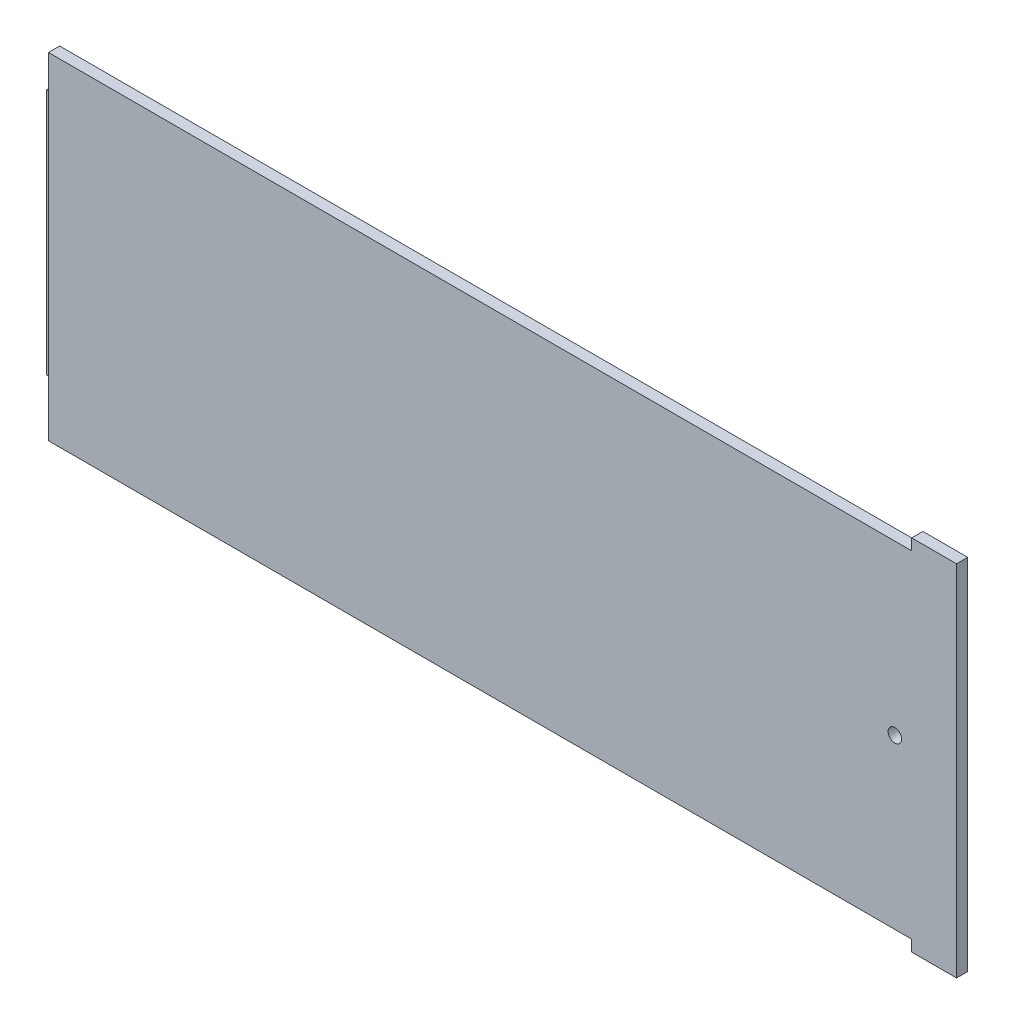
ISO-10303-21;
HEADER;
FILE_DESCRIPTION(('STEP AP214'),'2;1');
FILE_NAME('part.step','',(''),(''),'','','');
FILE_SCHEMA(('AUTOMOTIVE_DESIGN { 1 0 10303 214 1 1 1 1 }'));
ENDSEC;
DATA;
#1=APPLICATION_CONTEXT('core data for automotive mechanical design processes');
#2=APPLICATION_PROTOCOL_DEFINITION('international standard','automotive_design',2000,#1);
#3=PRODUCT_CONTEXT('',#1,'mechanical');
#4=PRODUCT('Part','Part','',(#3));
#5=PRODUCT_RELATED_PRODUCT_CATEGORY('part','',(#4));
#6=PRODUCT_DEFINITION_FORMATION('','',#4);
#7=PRODUCT_DEFINITION_CONTEXT('part definition',#1,'design');
#8=PRODUCT_DEFINITION('design','',#6,#7);
#9=PRODUCT_DEFINITION_SHAPE('','',#8);
#10=(LENGTH_UNIT() NAMED_UNIT(*) SI_UNIT(.MILLI.,.METRE.));
#11=(NAMED_UNIT(*) PLANE_ANGLE_UNIT() SI_UNIT($,.RADIAN.));
#12=(NAMED_UNIT(*) SI_UNIT($,.STERADIAN.) SOLID_ANGLE_UNIT());
#13=UNCERTAINTY_MEASURE_WITH_UNIT(LENGTH_MEASURE(1.E-05),#10,'distance_accuracy_value','');
#14=(GEOMETRIC_REPRESENTATION_CONTEXT(3) GLOBAL_UNCERTAINTY_ASSIGNED_CONTEXT((#13)) GLOBAL_UNIT_ASSIGNED_CONTEXT((#10,
#11,#12)) REPRESENTATION_CONTEXT('',''));
#15=CARTESIAN_POINT('',(0.,0.,0.));
#16=DIRECTION('',(0.,0.,1.));
#17=DIRECTION('',(1.,0.,0.));
#18=AXIS2_PLACEMENT_3D('',#15,#16,#17);
#19=CARTESIAN_POINT('',(0.,0.,2.5));
#20=DIRECTION('',(1.,0.,0.));
#21=DIRECTION('',(0.,0.,-1.));
#22=AXIS2_PLACEMENT_3D('',#19,#20,#21);
#23=PLANE('',#22);
#24=DIRECTION('',(0.,1.,0.));
#25=VECTOR('',#24,1.);
#26=CARTESIAN_POINT('',(0.,65.,0.));
#27=LINE('',#26,#25);
#28=CARTESIAN_POINT('',(0.,10.,0.));
#29=VERTEX_POINT('',#28);
#30=CARTESIAN_POINT('',(0.,65.,0.));
#31=VERTEX_POINT('',#30);
#32=EDGE_CURVE('E55',#29,#31,#27,.T.);
#33=ORIENTED_EDGE('',*,*,#32,.F.);
#34=DIRECTION('',(0.,-1.,0.));
#35=VECTOR('',#34,1.);
#36=CARTESIAN_POINT('',(0.,0.,0.));
#37=LINE('',#36,#35);
#38=CARTESIAN_POINT('',(0.,0.,0.));
#39=VERTEX_POINT('',#38);
#40=EDGE_CURVE('E217',#29,#39,#37,.T.);
#41=ORIENTED_EDGE('',*,*,#40,.T.);
#42=DIRECTION('',(0.,0.,-1.));
#43=VECTOR('',#42,1.);
#44=CARTESIAN_POINT('',(0.,0.,2.5));
#45=LINE('',#44,#43);
#46=CARTESIAN_POINT('',(0.,0.,2.5));
#47=VERTEX_POINT('',#46);
#48=EDGE_CURVE('E11',#47,#39,#45,.T.);
#49=ORIENTED_EDGE('',*,*,#48,.F.);
#50=DIRECTION('',(0.,-1.,0.));
#51=VECTOR('',#50,1.);
#52=CARTESIAN_POINT('',(0.,0.,2.5));
#53=LINE('',#52,#51);
#54=CARTESIAN_POINT('',(0.,75.,2.5));
#55=VERTEX_POINT('',#54);
#56=EDGE_CURVE('E218',#55,#47,#53,.T.);
#57=ORIENTED_EDGE('',*,*,#56,.F.);
#58=DIRECTION('',(0.,0.,-1.));
#59=VECTOR('',#58,1.);
#60=CARTESIAN_POINT('',(0.,75.,2.5));
#61=LINE('',#60,#59);
#62=CARTESIAN_POINT('',(0.,75.,0.));
#63=VERTEX_POINT('',#62);
#64=EDGE_CURVE('E40',#55,#63,#61,.T.);
#65=ORIENTED_EDGE('',*,*,#64,.T.);
#66=EDGE_CURVE('E229',#63,#31,#37,.T.);
#67=ORIENTED_EDGE('',*,*,#66,.T.);
#68=EDGE_LOOP('',(#33,#41,#49,#57,#65,#67));
#69=FACE_BOUND('',#68,.T.);
#70=ADVANCED_FACE('F33',(#69),#23,.F.);
#71=CARTESIAN_POINT('',(0.,0.,2.5));
#72=DIRECTION('',(0.,1.,0.));
#73=DIRECTION('',(0.,0.,1.));
#74=AXIS2_PLACEMENT_3D('',#71,#72,#73);
#75=PLANE('',#74);
#76=DIRECTION('',(0.,0.,-1.));
#77=VECTOR('',#76,1.);
#78=CARTESIAN_POINT('',(192.5,0.,0.));
#79=LINE('',#78,#77);
#80=CARTESIAN_POINT('',(192.5,0.,2.5));
#81=VERTEX_POINT('',#80);
#82=CARTESIAN_POINT('',(192.5,0.,0.));
#83=VERTEX_POINT('',#82);
#84=EDGE_CURVE('E177',#81,#83,#79,.T.);
#85=ORIENTED_EDGE('',*,*,#84,.F.);
#86=DIRECTION('',(1.,0.,0.));
#87=VECTOR('',#86,1.);
#88=CARTESIAN_POINT('',(0.,0.,2.5));
#89=LINE('',#88,#87);
#90=EDGE_CURVE('E221',#47,#81,#89,.T.);
#91=ORIENTED_EDGE('',*,*,#90,.F.);
#92=ORIENTED_EDGE('',*,*,#48,.T.);
#93=DIRECTION('',(1.,0.,0.));
#94=VECTOR('',#93,1.);
#95=CARTESIAN_POINT('',(0.,0.,0.));
#96=LINE('',#95,#94);
#97=EDGE_CURVE('E231',#39,#83,#96,.T.);
#98=ORIENTED_EDGE('',*,*,#97,.T.);
#99=EDGE_LOOP('',(#85,#91,#92,#98));
#100=FACE_BOUND('',#99,.T.);
#101=ADVANCED_FACE('F266',(#100),#75,.F.);
#102=CARTESIAN_POINT('',(0.,75.,2.5));
#103=DIRECTION('',(0.,-1.,0.));
#104=DIRECTION('',(0.,0.,-1.));
#105=AXIS2_PLACEMENT_3D('',#102,#103,#104);
#106=PLANE('',#105);
#107=DIRECTION('',(0.,0.,1.));
#108=VECTOR('',#107,1.);
#109=CARTESIAN_POINT('',(192.5,75.,2.5));
#110=LINE('',#109,#108);
#111=CARTESIAN_POINT('',(192.5,75.,0.));
#112=VERTEX_POINT('',#111);
#113=CARTESIAN_POINT('',(192.5,75.,2.5));
#114=VERTEX_POINT('',#113);
#115=EDGE_CURVE('E197',#112,#114,#110,.T.);
#116=ORIENTED_EDGE('',*,*,#115,.F.);
#117=DIRECTION('',(-1.,0.,0.));
#118=VECTOR('',#117,1.);
#119=CARTESIAN_POINT('',(0.,75.,0.));
#120=LINE('',#119,#118);
#121=EDGE_CURVE('E222',#112,#63,#120,.T.);
#122=ORIENTED_EDGE('',*,*,#121,.T.);
#123=ORIENTED_EDGE('',*,*,#64,.F.);
#124=DIRECTION('',(-1.,0.,0.));
#125=VECTOR('',#124,1.);
#126=CARTESIAN_POINT('',(0.,75.,2.5));
#127=LINE('',#126,#125);
#128=EDGE_CURVE('E227',#114,#55,#127,.T.);
#129=ORIENTED_EDGE('',*,*,#128,.F.);
#130=EDGE_LOOP('',(#116,#122,#123,#129));
#131=FACE_BOUND('',#130,.T.);
#132=ADVANCED_FACE('F270',(#131),#106,.F.);
#133=CARTESIAN_POINT('',(202.5,0.,2.5));
#134=DIRECTION('',(-1.,0.,0.));
#135=DIRECTION('',(0.,0.,1.));
#136=AXIS2_PLACEMENT_3D('',#133,#134,#135);
#137=PLANE('',#136);
#138=DIRECTION('',(0.,1.,0.));
#139=VECTOR('',#138,1.);
#140=CARTESIAN_POINT('',(202.5,0.,0.));
#141=LINE('',#140,#139);
#142=CARTESIAN_POINT('',(202.5,-2.5,0.));
#143=VERTEX_POINT('',#142);
#144=CARTESIAN_POINT('',(202.5,77.5,0.));
#145=VERTEX_POINT('',#144);
#146=EDGE_CURVE('E233',#143,#145,#141,.T.);
#147=ORIENTED_EDGE('',*,*,#146,.T.);
#148=DIRECTION('',(0.,0.,-1.));
#149=VECTOR('',#148,1.);
#150=CARTESIAN_POINT('',(202.5,77.5,2.5));
#151=LINE('',#150,#149);
#152=CARTESIAN_POINT('',(202.5,77.5,2.5));
#153=VERTEX_POINT('',#152);
#154=EDGE_CURVE('E204',#153,#145,#151,.T.);
#155=ORIENTED_EDGE('',*,*,#154,.F.);
#156=DIRECTION('',(0.,1.,0.));
#157=VECTOR('',#156,1.);
#158=CARTESIAN_POINT('',(202.5,0.,2.5));
#159=LINE('',#158,#157);
#160=CARTESIAN_POINT('',(202.5,-2.5,2.5));
#161=VERTEX_POINT('',#160);
#162=EDGE_CURVE('E225',#161,#153,#159,.T.);
#163=ORIENTED_EDGE('',*,*,#162,.F.);
#164=DIRECTION('',(0.,0.,1.));
#165=VECTOR('',#164,1.);
#166=CARTESIAN_POINT('',(202.5,-2.5,0.));
#167=LINE('',#166,#165);
#168=EDGE_CURVE('E184',#143,#161,#167,.T.);
#169=ORIENTED_EDGE('',*,*,#168,.F.);
#170=EDGE_LOOP('',(#147,#155,#163,#169));
#171=FACE_BOUND('',#170,.T.);
#172=ADVANCED_FACE('F275',(#171),#137,.F.);
#173=CARTESIAN_POINT('',(0.,0.,2.5));
#174=DIRECTION('',(0.,0.,-1.));
#175=DIRECTION('',(-1.,0.,0.));
#176=AXIS2_PLACEMENT_3D('',#173,#174,#175);
#177=PLANE('',#176);
#178=CARTESIAN_POINT('',(188.75,37.5,2.5));
#179=DIRECTION('',(0.,0.,1.));
#180=DIRECTION('',(1.,0.,0.));
#181=AXIS2_PLACEMENT_3D('',#178,#179,#180);
#182=CIRCLE('',#181,1.5);
#183=CARTESIAN_POINT('',(190.25,37.5,2.5));
#184=VERTEX_POINT('',#183);
#185=EDGE_CURVE('E171',#184,#184,#182,.T.);
#186=ORIENTED_EDGE('',*,*,#185,.F.);
#187=EDGE_LOOP('',(#186));
#188=FACE_BOUND('',#187,.T.);
#189=ORIENTED_EDGE('',*,*,#56,.T.);
#190=ORIENTED_EDGE('',*,*,#90,.T.);
#191=DIRECTION('',(0.,1.,0.));
#192=VECTOR('',#191,1.);
#193=CARTESIAN_POINT('',(192.5,-2.5,2.5));
#194=LINE('',#193,#192);
#195=CARTESIAN_POINT('',(192.5,-2.5,2.5));
#196=VERTEX_POINT('',#195);
#197=EDGE_CURVE('E189',#196,#81,#194,.T.);
#198=ORIENTED_EDGE('',*,*,#197,.F.);
#199=DIRECTION('',(-1.,0.,0.));
#200=VECTOR('',#199,1.);
#201=CARTESIAN_POINT('',(192.5,-2.5,2.5));
#202=LINE('',#201,#200);
#203=EDGE_CURVE('E187',#161,#196,#202,.T.);
#204=ORIENTED_EDGE('',*,*,#203,.F.);
#205=ORIENTED_EDGE('',*,*,#162,.T.);
#206=DIRECTION('',(1.,0.,0.));
#207=VECTOR('',#206,1.);
#208=CARTESIAN_POINT('',(192.5,77.5,2.5));
#209=LINE('',#208,#207);
#210=CARTESIAN_POINT('',(192.5,77.5,2.5));
#211=VERTEX_POINT('',#210);
#212=EDGE_CURVE('E201',#211,#153,#209,.T.);
#213=ORIENTED_EDGE('',*,*,#212,.F.);
#214=DIRECTION('',(0.,-1.,0.));
#215=VECTOR('',#214,1.);
#216=CARTESIAN_POINT('',(192.5,77.5,2.5));
#217=LINE('',#216,#215);
#218=EDGE_CURVE('E214',#211,#114,#217,.T.);
#219=ORIENTED_EDGE('',*,*,#218,.T.);
#220=ORIENTED_EDGE('',*,*,#128,.T.);
#221=EDGE_LOOP('',(#189,#190,#198,#204,#205,#213,#219,#220));
#222=FACE_BOUND('',#221,.T.);
#223=ADVANCED_FACE('F279',(#188,#222),#177,.F.);
#224=CARTESIAN_POINT('',(0.,0.,0.));
#225=DIRECTION('',(0.,0.,-1.));
#226=DIRECTION('',(-1.,0.,0.));
#227=AXIS2_PLACEMENT_3D('',#224,#225,#226);
#228=PLANE('',#227);
#229=DIRECTION('',(-1.,0.,0.));
#230=VECTOR('',#229,1.);
#231=CARTESIAN_POINT('',(0.,10.,0.));
#232=LINE('',#231,#230);
#233=CARTESIAN_POINT('',(2.49999999999999,10.,0.));
#234=VERTEX_POINT('',#233);
#235=EDGE_CURVE('E47',#234,#29,#232,.T.);
#236=ORIENTED_EDGE('',*,*,#235,.F.);
#237=DIRECTION('',(0.,-1.,0.));
#238=VECTOR('',#237,1.);
#239=CARTESIAN_POINT('',(2.5,65.,0.));
#240=LINE('',#239,#238);
#241=CARTESIAN_POINT('',(2.5,65.,0.));
#242=VERTEX_POINT('',#241);
#243=EDGE_CURVE('E153',#242,#234,#240,.T.);
#244=ORIENTED_EDGE('',*,*,#243,.F.);
#245=DIRECTION('',(1.,0.,0.));
#246=VECTOR('',#245,1.);
#247=CARTESIAN_POINT('',(0.,65.,0.));
#248=LINE('',#247,#246);
#249=EDGE_CURVE('E150',#31,#242,#248,.T.);
#250=ORIENTED_EDGE('',*,*,#249,.F.);
#251=ORIENTED_EDGE('',*,*,#66,.F.);
#252=ORIENTED_EDGE('',*,*,#121,.F.);
#253=DIRECTION('',(0.,-1.,0.));
#254=VECTOR('',#253,1.);
#255=CARTESIAN_POINT('',(192.5,77.5,0.));
#256=LINE('',#255,#254);
#257=CARTESIAN_POINT('',(192.5,77.5,0.));
#258=VERTEX_POINT('',#257);
#259=EDGE_CURVE('E209',#258,#112,#256,.T.);
#260=ORIENTED_EDGE('',*,*,#259,.F.);
#261=DIRECTION('',(-1.,0.,0.));
#262=VECTOR('',#261,1.);
#263=CARTESIAN_POINT('',(192.5,77.5,0.));
#264=LINE('',#263,#262);
#265=EDGE_CURVE('E207',#145,#258,#264,.T.);
#266=ORIENTED_EDGE('',*,*,#265,.F.);
#267=ORIENTED_EDGE('',*,*,#146,.F.);
#268=DIRECTION('',(1.,0.,0.));
#269=VECTOR('',#268,1.);
#270=CARTESIAN_POINT('',(192.5,-2.5,0.));
#271=LINE('',#270,#269);
#272=CARTESIAN_POINT('',(192.5,-2.5,0.));
#273=VERTEX_POINT('',#272);
#274=EDGE_CURVE('E181',#273,#143,#271,.T.);
#275=ORIENTED_EDGE('',*,*,#274,.F.);
#276=DIRECTION('',(0.,1.,0.));
#277=VECTOR('',#276,1.);
#278=CARTESIAN_POINT('',(192.5,-2.5,0.));
#279=LINE('',#278,#277);
#280=EDGE_CURVE('E194',#273,#83,#279,.T.);
#281=ORIENTED_EDGE('',*,*,#280,.T.);
#282=ORIENTED_EDGE('',*,*,#97,.F.);
#283=ORIENTED_EDGE('',*,*,#40,.F.);
#284=EDGE_LOOP('',(#236,#244,#250,#251,#252,#260,#266,#267,#275,#281,#282,#283));
#285=FACE_BOUND('',#284,.T.);
#286=CARTESIAN_POINT('',(188.75,37.5,0.));
#287=DIRECTION('',(0.,0.,-1.));
#288=DIRECTION('',(-1.,0.,0.));
#289=AXIS2_PLACEMENT_3D('',#286,#287,#288);
#290=CIRCLE('',#289,1.5);
#291=CARTESIAN_POINT('',(187.25,37.5,0.));
#292=VERTEX_POINT('',#291);
#293=EDGE_CURVE('E174',#292,#292,#290,.F.);
#294=ORIENTED_EDGE('',*,*,#293,.T.);
#295=EDGE_LOOP('',(#294));
#296=FACE_BOUND('',#295,.T.);
#297=ADVANCED_FACE('F243',(#285,#296),#228,.T.);
#298=CARTESIAN_POINT('',(192.5,77.5,2.5));
#299=DIRECTION('',(1.,0.,0.));
#300=DIRECTION('',(0.,0.,-1.));
#301=AXIS2_PLACEMENT_3D('',#298,#299,#300);
#302=PLANE('',#301);
#303=ORIENTED_EDGE('',*,*,#115,.T.);
#304=ORIENTED_EDGE('',*,*,#218,.F.);
#305=DIRECTION('',(0.,0.,1.));
#306=VECTOR('',#305,1.);
#307=CARTESIAN_POINT('',(192.5,77.5,2.5));
#308=LINE('',#307,#306);
#309=EDGE_CURVE('E198',#258,#211,#308,.T.);
#310=ORIENTED_EDGE('',*,*,#309,.F.);
#311=ORIENTED_EDGE('',*,*,#259,.T.);
#312=EDGE_LOOP('',(#303,#304,#310,#311));
#313=FACE_BOUND('',#312,.T.);
#314=ADVANCED_FACE('F284',(#313),#302,.F.);
#315=CARTESIAN_POINT('',(0.,77.5,0.));
#316=DIRECTION('',(0.,-1.,0.));
#317=DIRECTION('',(0.,0.,-1.));
#318=AXIS2_PLACEMENT_3D('',#315,#316,#317);
#319=PLANE('',#318);
#320=ORIENTED_EDGE('',*,*,#309,.T.);
#321=ORIENTED_EDGE('',*,*,#212,.T.);
#322=ORIENTED_EDGE('',*,*,#154,.T.);
#323=ORIENTED_EDGE('',*,*,#265,.T.);
#324=EDGE_LOOP('',(#320,#321,#322,#323));
#325=FACE_BOUND('',#324,.T.);
#326=ADVANCED_FACE('F290',(#325),#319,.F.);
#327=CARTESIAN_POINT('',(192.5,-2.5,0.));
#328=DIRECTION('',(1.,0.,0.));
#329=DIRECTION('',(0.,0.,-1.));
#330=AXIS2_PLACEMENT_3D('',#327,#328,#329);
#331=PLANE('',#330);
#332=ORIENTED_EDGE('',*,*,#84,.T.);
#333=ORIENTED_EDGE('',*,*,#280,.F.);
#334=DIRECTION('',(0.,0.,-1.));
#335=VECTOR('',#334,1.);
#336=CARTESIAN_POINT('',(192.5,-2.5,0.));
#337=LINE('',#336,#335);
#338=EDGE_CURVE('E178',#196,#273,#337,.T.);
#339=ORIENTED_EDGE('',*,*,#338,.F.);
#340=ORIENTED_EDGE('',*,*,#197,.T.);
#341=EDGE_LOOP('',(#332,#333,#339,#340));
#342=FACE_BOUND('',#341,.T.);
#343=ADVANCED_FACE('F294',(#342),#331,.F.);
#344=CARTESIAN_POINT('',(0.,-2.5,0.));
#345=DIRECTION('',(0.,1.,0.));
#346=DIRECTION('',(0.,0.,1.));
#347=AXIS2_PLACEMENT_3D('',#344,#345,#346);
#348=PLANE('',#347);
#349=ORIENTED_EDGE('',*,*,#338,.T.);
#350=ORIENTED_EDGE('',*,*,#274,.T.);
#351=ORIENTED_EDGE('',*,*,#168,.T.);
#352=ORIENTED_EDGE('',*,*,#203,.T.);
#353=EDGE_LOOP('',(#349,#350,#351,#352));
#354=FACE_BOUND('',#353,.T.);
#355=ADVANCED_FACE('F298',(#354),#348,.F.);
#356=CARTESIAN_POINT('',(188.75,37.5,-4.24264068711928));
#357=DIRECTION('',(0.,0.,1.));
#358=DIRECTION('',(1.,0.,0.));
#359=AXIS2_PLACEMENT_3D('',#356,#357,#358);
#360=CYLINDRICAL_SURFACE('',#359,1.5);
#361=ORIENTED_EDGE('',*,*,#185,.T.);
#362=EDGE_LOOP('',(#361));
#363=FACE_BOUND('',#362,.T.);
#364=ORIENTED_EDGE('',*,*,#293,.F.);
#365=EDGE_LOOP('',(#364));
#366=FACE_BOUND('',#365,.T.);
#367=ADVANCED_FACE('F302',(#363,#366),#360,.F.);
#368=CARTESIAN_POINT('',(0.,65.,-2.5));
#369=DIRECTION('',(0.,-1.,0.));
#370=DIRECTION('',(0.,0.,-1.));
#371=AXIS2_PLACEMENT_3D('',#368,#369,#370);
#372=PLANE('',#371);
#373=ORIENTED_EDGE('',*,*,#249,.T.);
#374=DIRECTION('',(0.,0.,1.));
#375=VECTOR('',#374,1.);
#376=CARTESIAN_POINT('',(2.5,65.,-2.5));
#377=LINE('',#376,#375);
#378=CARTESIAN_POINT('',(2.5,65.,-2.5));
#379=VERTEX_POINT('',#378);
#380=EDGE_CURVE('E168',#379,#242,#377,.T.);
#381=ORIENTED_EDGE('',*,*,#380,.F.);
#382=DIRECTION('',(1.,0.,0.));
#383=VECTOR('',#382,1.);
#384=CARTESIAN_POINT('',(0.,65.,-2.5));
#385=LINE('',#384,#383);
#386=CARTESIAN_POINT('',(-3.,65.,-2.5));
#387=VERTEX_POINT('',#386);
#388=EDGE_CURVE('E134',#387,#379,#385,.T.);
#389=ORIENTED_EDGE('',*,*,#388,.F.);
#390=DIRECTION('',(0.,0.,-1.));
#391=VECTOR('',#390,1.);
#392=CARTESIAN_POINT('',(-3.,65.,0.));
#393=LINE('',#392,#391);
#394=CARTESIAN_POINT('',(-3.,65.,0.));
#395=VERTEX_POINT('',#394);
#396=EDGE_CURVE('E127',#395,#387,#393,.T.);
#397=ORIENTED_EDGE('',*,*,#396,.F.);
#398=DIRECTION('',(1.,0.,0.));
#399=VECTOR('',#398,1.);
#400=CARTESIAN_POINT('',(-3.,65.,0.));
#401=LINE('',#400,#399);
#402=EDGE_CURVE('E132',#395,#31,#401,.T.);
#403=ORIENTED_EDGE('',*,*,#402,.T.);
#404=EDGE_LOOP('',(#373,#381,#389,#397,#403));
#405=FACE_BOUND('',#404,.T.);
#406=ADVANCED_FACE('F130',(#405),#372,.F.);
#407=CARTESIAN_POINT('',(2.5,65.,-2.5));
#408=DIRECTION('',(-1.,0.,0.));
#409=DIRECTION('',(0.,-1.,0.));
#410=AXIS2_PLACEMENT_3D('',#407,#408,#409);
#411=PLANE('',#410);
#412=ORIENTED_EDGE('',*,*,#243,.T.);
#413=DIRECTION('',(0.,0.,1.));
#414=VECTOR('',#413,1.);
#415=CARTESIAN_POINT('',(2.49999999999999,10.,-2.5));
#416=LINE('',#415,#414);
#417=CARTESIAN_POINT('',(2.49999999999999,10.,-2.5));
#418=VERTEX_POINT('',#417);
#419=EDGE_CURVE('E162',#418,#234,#416,.T.);
#420=ORIENTED_EDGE('',*,*,#419,.F.);
#421=DIRECTION('',(0.,-1.,0.));
#422=VECTOR('',#421,1.);
#423=CARTESIAN_POINT('',(2.5,65.,-2.5));
#424=LINE('',#423,#422);
#425=EDGE_CURVE('E159',#379,#418,#424,.T.);
#426=ORIENTED_EDGE('',*,*,#425,.F.);
#427=ORIENTED_EDGE('',*,*,#380,.T.);
#428=EDGE_LOOP('',(#412,#420,#426,#427));
#429=FACE_BOUND('',#428,.T.);
#430=ADVANCED_FACE('F248',(#429),#411,.F.);
#431=CARTESIAN_POINT('',(0.,10.,-2.5));
#432=DIRECTION('',(0.,1.,0.));
#433=DIRECTION('',(0.,0.,1.));
#434=AXIS2_PLACEMENT_3D('',#431,#432,#433);
#435=PLANE('',#434);
#436=ORIENTED_EDGE('',*,*,#235,.T.);
#437=DIRECTION('',(1.,0.,0.));
#438=VECTOR('',#437,1.);
#439=CARTESIAN_POINT('',(-3.,10.,0.));
#440=LINE('',#439,#438);
#441=CARTESIAN_POINT('',(-3.,10.,0.));
#442=VERTEX_POINT('',#441);
#443=EDGE_CURVE('E151',#442,#29,#440,.T.);
#444=ORIENTED_EDGE('',*,*,#443,.F.);
#445=DIRECTION('',(0.,0.,1.));
#446=VECTOR('',#445,1.);
#447=CARTESIAN_POINT('',(-3.,10.,0.));
#448=LINE('',#447,#446);
#449=CARTESIAN_POINT('',(-3.,10.,-2.5));
#450=VERTEX_POINT('',#449);
#451=EDGE_CURVE('E144',#450,#442,#448,.T.);
#452=ORIENTED_EDGE('',*,*,#451,.F.);
#453=DIRECTION('',(-1.,0.,0.));
#454=VECTOR('',#453,1.);
#455=CARTESIAN_POINT('',(0.,10.,-2.5));
#456=LINE('',#455,#454);
#457=EDGE_CURVE('E161',#418,#450,#456,.T.);
#458=ORIENTED_EDGE('',*,*,#457,.F.);
#459=ORIENTED_EDGE('',*,*,#419,.T.);
#460=EDGE_LOOP('',(#436,#444,#452,#458,#459));
#461=FACE_BOUND('',#460,.T.);
#462=ADVANCED_FACE('F256',(#461),#435,.F.);
#463=CARTESIAN_POINT('',(0.,0.,-2.5));
#464=DIRECTION('',(0.,0.,1.));
#465=DIRECTION('',(1.,0.,0.));
#466=AXIS2_PLACEMENT_3D('',#463,#464,#465);
#467=PLANE('',#466);
#468=ORIENTED_EDGE('',*,*,#457,.T.);
#469=DIRECTION('',(0.,-1.,0.));
#470=VECTOR('',#469,1.);
#471=CARTESIAN_POINT('',(-3.,65.,-2.5));
#472=LINE('',#471,#470);
#473=EDGE_CURVE('E138',#387,#450,#472,.T.);
#474=ORIENTED_EDGE('',*,*,#473,.F.);
#475=ORIENTED_EDGE('',*,*,#388,.T.);
#476=ORIENTED_EDGE('',*,*,#425,.T.);
#477=EDGE_LOOP('',(#468,#474,#475,#476));
#478=FACE_BOUND('',#477,.T.);
#479=ADVANCED_FACE('F252',(#478),#467,.F.);
#480=CARTESIAN_POINT('',(-3.,65.,0.));
#481=DIRECTION('',(0.,0.,-1.));
#482=DIRECTION('',(-1.,0.,0.));
#483=AXIS2_PLACEMENT_3D('',#480,#481,#482);
#484=PLANE('',#483);
#485=ORIENTED_EDGE('',*,*,#32,.T.);
#486=ORIENTED_EDGE('',*,*,#402,.F.);
#487=DIRECTION('',(0.,1.,0.));
#488=VECTOR('',#487,1.);
#489=CARTESIAN_POINT('',(-3.,65.,0.));
#490=LINE('',#489,#488);
#491=EDGE_CURVE('E139',#442,#395,#490,.T.);
#492=ORIENTED_EDGE('',*,*,#491,.F.);
#493=ORIENTED_EDGE('',*,*,#443,.T.);
#494=EDGE_LOOP('',(#485,#486,#492,#493));
#495=FACE_BOUND('',#494,.T.);
#496=ADVANCED_FACE('F149',(#495),#484,.F.);
#497=CARTESIAN_POINT('',(-3.,0.,0.));
#498=DIRECTION('',(1.,0.,0.));
#499=DIRECTION('',(0.,0.,-1.));
#500=AXIS2_PLACEMENT_3D('',#497,#498,#499);
#501=PLANE('',#500);
#502=ORIENTED_EDGE('',*,*,#491,.T.);
#503=ORIENTED_EDGE('',*,*,#396,.T.);
#504=ORIENTED_EDGE('',*,*,#473,.T.);
#505=ORIENTED_EDGE('',*,*,#451,.T.);
#506=EDGE_LOOP('',(#502,#503,#504,#505));
#507=FACE_BOUND('',#506,.T.);
#508=ADVANCED_FACE('F142',(#507),#501,.F.);
#509=CLOSED_SHELL('',(#70,#101,#132,#172,#223,#297,#314,#326,#343,#355,#367,#406,#430,#462,#479,
#496,#508));
#510=MANIFOLD_SOLID_BREP('B2',#509);
#511=ADVANCED_BREP_SHAPE_REPRESENTATION('',(#18,#510),#14);
#512=SHAPE_DEFINITION_REPRESENTATION(#9,#511);
ENDSEC;
END-ISO-10303-21;
